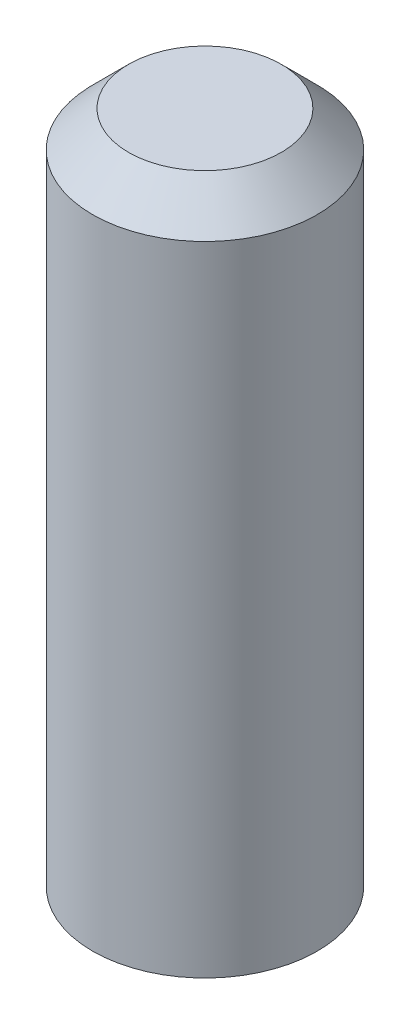
ISO-10303-21;
HEADER;
FILE_DESCRIPTION(('STEP AP214'),'2;1');
FILE_NAME('part.step','',(''),(''),'','','');
FILE_SCHEMA(('AUTOMOTIVE_DESIGN { 1 0 10303 214 1 1 1 1 }'));
ENDSEC;
DATA;
#1=APPLICATION_CONTEXT('core data for automotive mechanical design processes');
#2=APPLICATION_PROTOCOL_DEFINITION('international standard','automotive_design',2000,#1);
#3=PRODUCT_CONTEXT('',#1,'mechanical');
#4=PRODUCT('Part','Part','',(#3));
#5=PRODUCT_RELATED_PRODUCT_CATEGORY('part','',(#4));
#6=PRODUCT_DEFINITION_FORMATION('','',#4);
#7=PRODUCT_DEFINITION_CONTEXT('part definition',#1,'design');
#8=PRODUCT_DEFINITION('design','',#6,#7);
#9=PRODUCT_DEFINITION_SHAPE('','',#8);
#10=(LENGTH_UNIT() NAMED_UNIT(*) SI_UNIT(.MILLI.,.METRE.));
#11=(NAMED_UNIT(*) PLANE_ANGLE_UNIT() SI_UNIT($,.RADIAN.));
#12=(NAMED_UNIT(*) SI_UNIT($,.STERADIAN.) SOLID_ANGLE_UNIT());
#13=UNCERTAINTY_MEASURE_WITH_UNIT(LENGTH_MEASURE(1.E-05),#10,'distance_accuracy_value','');
#14=(GEOMETRIC_REPRESENTATION_CONTEXT(3) GLOBAL_UNCERTAINTY_ASSIGNED_CONTEXT((#13)) GLOBAL_UNIT_ASSIGNED_CONTEXT((#10,
#11,#12)) REPRESENTATION_CONTEXT('',''));
#15=CARTESIAN_POINT('',(0.,0.,0.));
#16=DIRECTION('',(0.,0.,1.));
#17=DIRECTION('',(1.,0.,0.));
#18=AXIS2_PLACEMENT_3D('',#15,#16,#17);
#19=CARTESIAN_POINT('',(0.,15.,0.));
#20=DIRECTION('',(0.,-1.,0.));
#21=DIRECTION('',(0.,0.,-1.));
#22=AXIS2_PLACEMENT_3D('',#19,#20,#21);
#23=CYLINDRICAL_SURFACE('',#22,2.5);
#24=CARTESIAN_POINT('',(0.,14.2,0.));
#25=DIRECTION('',(0.,1.,0.));
#26=DIRECTION('',(0.,0.,1.));
#27=AXIS2_PLACEMENT_3D('',#24,#25,#26);
#28=CIRCLE('',#27,2.5);
#29=CARTESIAN_POINT('',(0.,14.2,2.5));
#30=VERTEX_POINT('',#29);
#31=EDGE_CURVE('E10',#30,#30,#28,.F.);
#32=ORIENTED_EDGE('',*,*,#31,.T.);
#33=EDGE_LOOP('',(#32));
#34=FACE_BOUND('',#33,.T.);
#35=CARTESIAN_POINT('',(0.,0.,0.));
#36=DIRECTION('',(0.,1.,0.));
#37=DIRECTION('',(0.,0.,1.));
#38=AXIS2_PLACEMENT_3D('',#35,#36,#37);
#39=CIRCLE('',#38,2.5);
#40=CARTESIAN_POINT('',(0.,0.,2.5));
#41=VERTEX_POINT('',#40);
#42=EDGE_CURVE('E41',#41,#41,#39,.T.);
#43=ORIENTED_EDGE('',*,*,#42,.T.);
#44=EDGE_LOOP('',(#43));
#45=FACE_BOUND('',#44,.T.);
#46=ADVANCED_FACE('F30',(#34,#45),#23,.T.);
#47=CARTESIAN_POINT('',(0.,15.,0.));
#48=DIRECTION('',(0.,1.,0.));
#49=DIRECTION('',(0.,0.,1.));
#50=AXIS2_PLACEMENT_3D('',#47,#48,#49);
#51=PLANE('',#50);
#52=CARTESIAN_POINT('',(0.,15.,0.));
#53=DIRECTION('',(0.,1.,0.));
#54=DIRECTION('',(0.,0.,1.));
#55=AXIS2_PLACEMENT_3D('',#52,#53,#54);
#56=CIRCLE('',#55,1.7);
#57=CARTESIAN_POINT('',(0.,15.,1.7));
#58=VERTEX_POINT('',#57);
#59=EDGE_CURVE('E37',#58,#58,#56,.T.);
#60=ORIENTED_EDGE('',*,*,#59,.T.);
#61=EDGE_LOOP('',(#60));
#62=FACE_BOUND('',#61,.T.);
#63=ADVANCED_FACE('F51',(#62),#51,.T.);
#64=CARTESIAN_POINT('',(0.,0.,0.));
#65=DIRECTION('',(0.,1.,0.));
#66=DIRECTION('',(0.,0.,1.));
#67=AXIS2_PLACEMENT_3D('',#64,#65,#66);
#68=PLANE('',#67);
#69=ORIENTED_EDGE('',*,*,#42,.F.);
#70=EDGE_LOOP('',(#69));
#71=FACE_BOUND('',#70,.T.);
#72=ADVANCED_FACE('F49',(#71),#68,.F.);
#73=CARTESIAN_POINT('',(0.,15.,0.));
#74=DIRECTION('',(0.,-1.,0.));
#75=DIRECTION('',(0.,0.,-1.));
#76=AXIS2_PLACEMENT_3D('',#73,#74,#75);
#77=CONICAL_SURFACE('',#76,1.7,0.785398163397446);
#78=ORIENTED_EDGE('',*,*,#31,.F.);
#79=EDGE_LOOP('',(#78));
#80=FACE_BOUND('',#79,.T.);
#81=ORIENTED_EDGE('',*,*,#59,.F.);
#82=EDGE_LOOP('',(#81));
#83=FACE_BOUND('',#82,.T.);
#84=ADVANCED_FACE('F32',(#80,#83),#77,.T.);
#85=CLOSED_SHELL('',(#46,#63,#72,#84));
#86=MANIFOLD_SOLID_BREP('B2',#85);
#87=ADVANCED_BREP_SHAPE_REPRESENTATION('',(#18,#86),#14);
#88=SHAPE_DEFINITION_REPRESENTATION(#9,#87);
ENDSEC;
END-ISO-10303-21;
